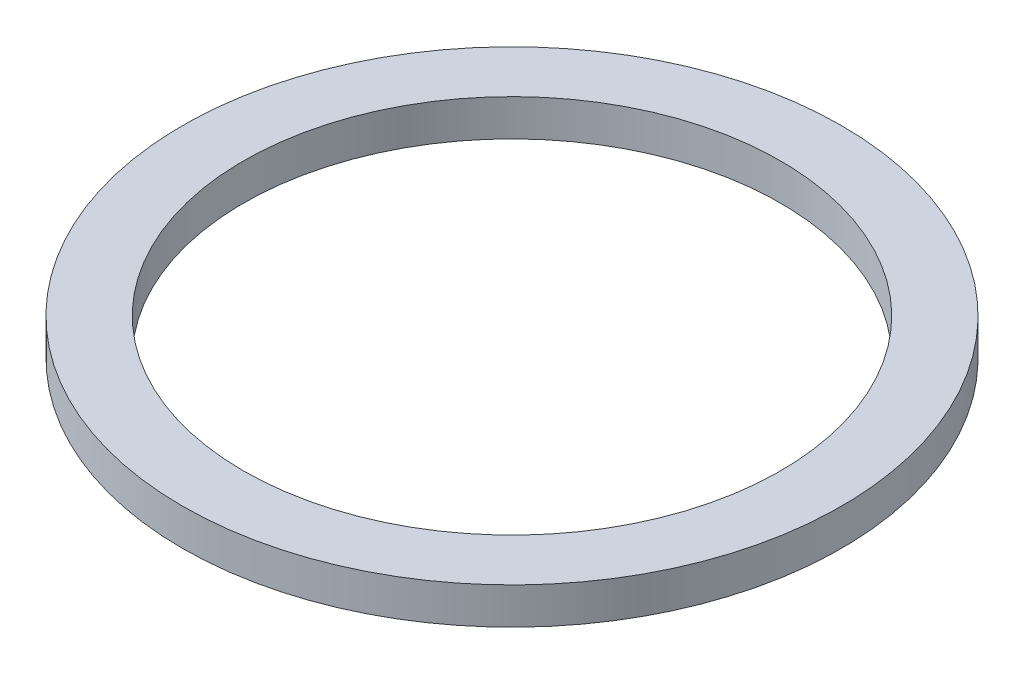
ISO-10303-21;
HEADER;
FILE_DESCRIPTION(('STEP AP214'),'2;1');
FILE_NAME('part.step','',(''),(''),'','','');
FILE_SCHEMA(('AUTOMOTIVE_DESIGN { 1 0 10303 214 1 1 1 1 }'));
ENDSEC;
DATA;
#1=APPLICATION_CONTEXT('core data for automotive mechanical design processes');
#2=APPLICATION_PROTOCOL_DEFINITION('international standard','automotive_design',2000,#1);
#3=PRODUCT_CONTEXT('',#1,'mechanical');
#4=PRODUCT('Part','Part','',(#3));
#5=PRODUCT_RELATED_PRODUCT_CATEGORY('part','',(#4));
#6=PRODUCT_DEFINITION_FORMATION('','',#4);
#7=PRODUCT_DEFINITION_CONTEXT('part definition',#1,'design');
#8=PRODUCT_DEFINITION('design','',#6,#7);
#9=PRODUCT_DEFINITION_SHAPE('','',#8);
#10=(LENGTH_UNIT() NAMED_UNIT(*) SI_UNIT(.MILLI.,.METRE.));
#11=(NAMED_UNIT(*) PLANE_ANGLE_UNIT() SI_UNIT($,.RADIAN.));
#12=(NAMED_UNIT(*) SI_UNIT($,.STERADIAN.) SOLID_ANGLE_UNIT());
#13=UNCERTAINTY_MEASURE_WITH_UNIT(LENGTH_MEASURE(1.E-05),#10,'distance_accuracy_value','');
#14=(GEOMETRIC_REPRESENTATION_CONTEXT(3) GLOBAL_UNCERTAINTY_ASSIGNED_CONTEXT((#13)) GLOBAL_UNIT_ASSIGNED_CONTEXT((#10,
#11,#12)) REPRESENTATION_CONTEXT('',''));
#15=CARTESIAN_POINT('',(0.,0.,0.));
#16=DIRECTION('',(0.,0.,1.));
#17=DIRECTION('',(1.,0.,0.));
#18=AXIS2_PLACEMENT_3D('',#15,#16,#17);
#19=CARTESIAN_POINT('',(0.,3.,0.));
#20=DIRECTION('',(0.,1.,0.));
#21=DIRECTION('',(0.,0.,1.));
#22=AXIS2_PLACEMENT_3D('',#19,#20,#21);
#23=PLANE('',#22);
#24=CARTESIAN_POINT('',(0.,3.,0.));
#25=DIRECTION('',(0.,1.,0.));
#26=DIRECTION('',(0.,0.,1.));
#27=AXIS2_PLACEMENT_3D('',#24,#25,#26);
#28=CIRCLE('',#27,27.);
#29=CARTESIAN_POINT('',(0.,3.,27.));
#30=VERTEX_POINT('',#29);
#31=EDGE_CURVE('E10',#30,#30,#28,.T.);
#32=ORIENTED_EDGE('',*,*,#31,.T.);
#33=EDGE_LOOP('',(#32));
#34=FACE_BOUND('',#33,.T.);
#35=CARTESIAN_POINT('',(0.,3.,0.));
#36=DIRECTION('',(0.,1.,0.));
#37=DIRECTION('',(0.,0.,1.));
#38=AXIS2_PLACEMENT_3D('',#35,#36,#37);
#39=CIRCLE('',#38,22.);
#40=CARTESIAN_POINT('',(0.,3.,22.));
#41=VERTEX_POINT('',#40);
#42=EDGE_CURVE('E42',#41,#41,#39,.T.);
#43=ORIENTED_EDGE('',*,*,#42,.F.);
#44=EDGE_LOOP('',(#43));
#45=FACE_BOUND('',#44,.T.);
#46=ADVANCED_FACE('F31',(#34,#45),#23,.T.);
#47=CARTESIAN_POINT('',(0.,0.,0.));
#48=DIRECTION('',(0.,1.,0.));
#49=DIRECTION('',(0.,0.,1.));
#50=AXIS2_PLACEMENT_3D('',#47,#48,#49);
#51=PLANE('',#50);
#52=CARTESIAN_POINT('',(0.,0.,0.));
#53=DIRECTION('',(0.,1.,0.));
#54=DIRECTION('',(0.,0.,1.));
#55=AXIS2_PLACEMENT_3D('',#52,#53,#54);
#56=CIRCLE('',#55,27.);
#57=CARTESIAN_POINT('',(0.,0.,27.));
#58=VERTEX_POINT('',#57);
#59=EDGE_CURVE('E35',#58,#58,#56,.T.);
#60=ORIENTED_EDGE('',*,*,#59,.F.);
#61=EDGE_LOOP('',(#60));
#62=FACE_BOUND('',#61,.T.);
#63=CARTESIAN_POINT('',(0.,0.,0.));
#64=DIRECTION('',(0.,1.,0.));
#65=DIRECTION('',(0.,0.,1.));
#66=AXIS2_PLACEMENT_3D('',#63,#64,#65);
#67=CIRCLE('',#66,22.);
#68=CARTESIAN_POINT('',(0.,0.,22.));
#69=VERTEX_POINT('',#68);
#70=EDGE_CURVE('E44',#69,#69,#67,.T.);
#71=ORIENTED_EDGE('',*,*,#70,.T.);
#72=EDGE_LOOP('',(#71));
#73=FACE_BOUND('',#72,.T.);
#74=ADVANCED_FACE('F54',(#62,#73),#51,.F.);
#75=CARTESIAN_POINT('',(0.,3.,0.));
#76=DIRECTION('',(0.,-1.,0.));
#77=DIRECTION('',(0.,0.,-1.));
#78=AXIS2_PLACEMENT_3D('',#75,#76,#77);
#79=CYLINDRICAL_SURFACE('',#78,27.);
#80=ORIENTED_EDGE('',*,*,#31,.F.);
#81=EDGE_LOOP('',(#80));
#82=FACE_BOUND('',#81,.T.);
#83=ORIENTED_EDGE('',*,*,#59,.T.);
#84=EDGE_LOOP('',(#83));
#85=FACE_BOUND('',#84,.T.);
#86=ADVANCED_FACE('F33',(#82,#85),#79,.T.);
#87=CARTESIAN_POINT('',(0.,3.,0.));
#88=DIRECTION('',(0.,-1.,0.));
#89=DIRECTION('',(0.,0.,-1.));
#90=AXIS2_PLACEMENT_3D('',#87,#88,#89);
#91=CYLINDRICAL_SURFACE('',#90,22.);
#92=ORIENTED_EDGE('',*,*,#42,.T.);
#93=EDGE_LOOP('',(#92));
#94=FACE_BOUND('',#93,.T.);
#95=ORIENTED_EDGE('',*,*,#70,.F.);
#96=EDGE_LOOP('',(#95));
#97=FACE_BOUND('',#96,.T.);
#98=ADVANCED_FACE('F50',(#94,#97),#91,.F.);
#99=CLOSED_SHELL('',(#46,#74,#86,#98));
#100=MANIFOLD_SOLID_BREP('B2',#99);
#101=ADVANCED_BREP_SHAPE_REPRESENTATION('',(#18,#100),#14);
#102=SHAPE_DEFINITION_REPRESENTATION(#9,#101);
ENDSEC;
END-ISO-10303-21;
